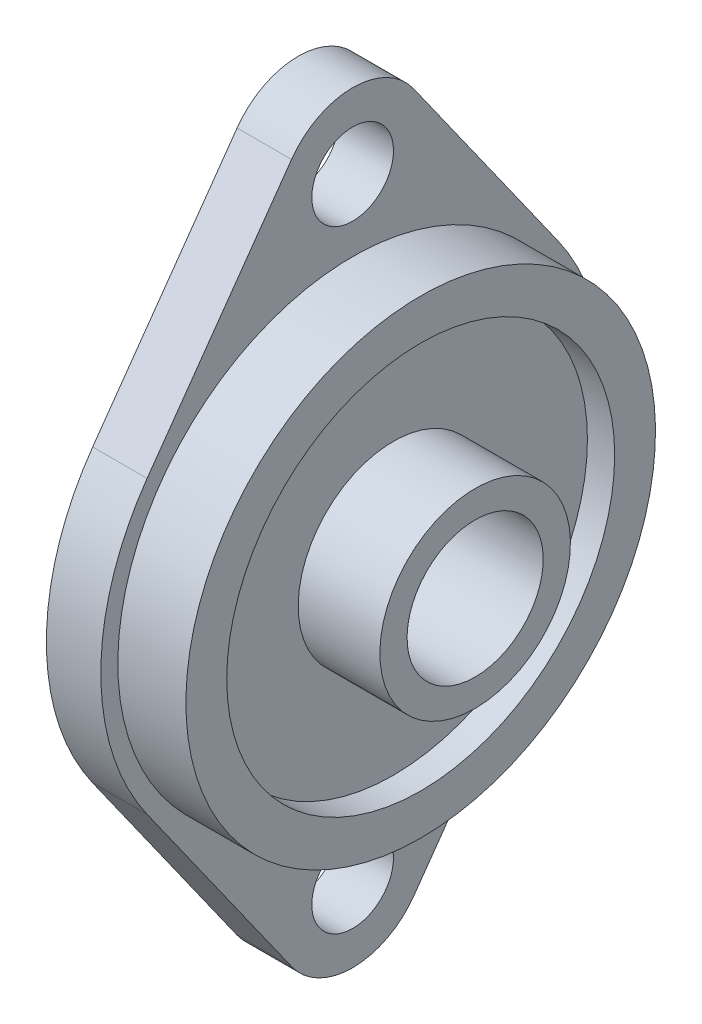
ISO-10303-21;
HEADER;
FILE_DESCRIPTION(('STEP AP214'),'2;1');
FILE_NAME('part.step','',(''),(''),'','','');
FILE_SCHEMA(('AUTOMOTIVE_DESIGN { 1 0 10303 214 1 1 1 1 }'));
ENDSEC;
DATA;
#1=APPLICATION_CONTEXT('core data for automotive mechanical design processes');
#2=APPLICATION_PROTOCOL_DEFINITION('international standard','automotive_design',2000,#1);
#3=PRODUCT_CONTEXT('',#1,'mechanical');
#4=PRODUCT('Part','Part','',(#3));
#5=PRODUCT_RELATED_PRODUCT_CATEGORY('part','',(#4));
#6=PRODUCT_DEFINITION_FORMATION('','',#4);
#7=PRODUCT_DEFINITION_CONTEXT('part definition',#1,'design');
#8=PRODUCT_DEFINITION('design','',#6,#7);
#9=PRODUCT_DEFINITION_SHAPE('','',#8);
#10=(LENGTH_UNIT() NAMED_UNIT(*) SI_UNIT(.MILLI.,.METRE.));
#11=(NAMED_UNIT(*) PLANE_ANGLE_UNIT() SI_UNIT($,.RADIAN.));
#12=(NAMED_UNIT(*) SI_UNIT($,.STERADIAN.) SOLID_ANGLE_UNIT());
#13=UNCERTAINTY_MEASURE_WITH_UNIT(LENGTH_MEASURE(1.E-05),#10,'distance_accuracy_value','');
#14=(GEOMETRIC_REPRESENTATION_CONTEXT(3) GLOBAL_UNCERTAINTY_ASSIGNED_CONTEXT((#13)) GLOBAL_UNIT_ASSIGNED_CONTEXT((#10,
#11,#12)) REPRESENTATION_CONTEXT('',''));
#15=CARTESIAN_POINT('',(0.,0.,0.));
#16=DIRECTION('',(0.,0.,1.));
#17=DIRECTION('',(1.,0.,0.));
#18=AXIS2_PLACEMENT_3D('',#15,#16,#17);
#19=CARTESIAN_POINT('',(0.,6.00408611717285E-12,0.));
#20=DIRECTION('',(1.,0.,0.));
#21=DIRECTION('',(0.,1.,0.));
#22=AXIS2_PLACEMENT_3D('',#19,#20,#21);
#23=PLANE('',#22);
#24=CARTESIAN_POINT('',(0.,-22.5,0.));
#25=DIRECTION('',(-1.,0.,0.));
#26=DIRECTION('',(0.,1.,0.));
#27=AXIS2_PLACEMENT_3D('',#24,#25,#26);
#28=CIRCLE('',#27,3.);
#29=CARTESIAN_POINT('',(0.,-25.5,0.));
#30=VERTEX_POINT('',#29);
#31=EDGE_CURVE('P0_E351',#30,#30,#28,.T.);
#32=ORIENTED_EDGE('',*,*,#31,.F.);
#33=EDGE_LOOP('',(#32));
#34=FACE_BOUND('',#33,.T.);
#35=CARTESIAN_POINT('',(0.,22.5,0.));
#36=DIRECTION('',(-1.,0.,0.));
#37=DIRECTION('',(0.,1.,0.));
#38=AXIS2_PLACEMENT_3D('',#35,#36,#37);
#39=CIRCLE('',#38,3.);
#40=CARTESIAN_POINT('',(0.,19.5,0.));
#41=VERTEX_POINT('',#40);
#42=EDGE_CURVE('P0_E155',#41,#41,#39,.T.);
#43=ORIENTED_EDGE('',*,*,#42,.F.);
#44=EDGE_LOOP('',(#43));
#45=FACE_BOUND('',#44,.T.);
#46=CARTESIAN_POINT('',(0.,0.,0.));
#47=DIRECTION('',(-1.,0.,0.));
#48=DIRECTION('',(0.,1.,0.));
#49=AXIS2_PLACEMENT_3D('',#46,#47,#48);
#50=CIRCLE('',#49,14.25);
#51=CARTESIAN_POINT('',(0.,-14.25,0.));
#52=VERTEX_POINT('',#51);
#53=EDGE_CURVE('P0_E330',#52,#52,#50,.T.);
#54=ORIENTED_EDGE('',*,*,#53,.F.);
#55=EDGE_LOOP('',(#54));
#56=FACE_BOUND('',#55,.T.);
#57=CARTESIAN_POINT('',(0.,-22.5,0.));
#58=DIRECTION('',(1.,0.,0.));
#59=DIRECTION('',(0.,-0.577777777778309,0.816194118764377));
#60=AXIS2_PLACEMENT_3D('',#57,#58,#59);
#61=CIRCLE('',#60,5.49999999998803);
#62=CARTESIAN_POINT('',(0.,-25.6777777777738,4.48906765319431));
#63=VERTEX_POINT('',#62);
#64=CARTESIAN_POINT('',(0.,-25.6777777777738,-4.48906765319431));
#65=VERTEX_POINT('',#64);
#66=EDGE_CURVE('P0_E25',#63,#65,#61,.T.);
#67=ORIENTED_EDGE('',*,*,#66,.F.);
#68=DIRECTION('',(0.,0.816194118764377,0.57777777777831));
#69=VECTOR('',#68,1.);
#70=CARTESIAN_POINT('',(0.,-25.6777777777738,4.48906765319431));
#71=LINE('',#70,#69);
#72=CARTESIAN_POINT('',(0.,-10.6888888888987,15.099591197141));
#73=VERTEX_POINT('',#72);
#74=EDGE_CURVE('P0_E148',#63,#73,#71,.T.);
#75=ORIENTED_EDGE('',*,*,#74,.T.);
#76=CARTESIAN_POINT('',(0.,0.,0.));
#77=DIRECTION('',(1.,0.,0.));
#78=DIRECTION('',(0.,0.577777777777771,0.816194118764759));
#79=AXIS2_PLACEMENT_3D('',#76,#77,#78);
#80=CIRCLE('',#79,18.5);
#81=CARTESIAN_POINT('',(0.,10.6888888888888,15.0995911971481));
#82=VERTEX_POINT('',#81);
#83=EDGE_CURVE('P0_E160',#82,#73,#80,.T.);
#84=ORIENTED_EDGE('',*,*,#83,.F.);
#85=DIRECTION('',(0.,-0.816194118764753,0.577777777777778));
#86=VECTOR('',#85,1.);
#87=CARTESIAN_POINT('',(0.,25.6777777777778,4.48906765320621));
#88=LINE('',#87,#86);
#89=CARTESIAN_POINT('',(0.,25.6777777777778,4.48906765320621));
#90=VERTEX_POINT('',#89);
#91=EDGE_CURVE('P0_E166',#90,#82,#88,.T.);
#92=ORIENTED_EDGE('',*,*,#91,.F.);
#93=CARTESIAN_POINT('',(0.,22.5,0.));
#94=DIRECTION('',(1.,0.,0.));
#95=DIRECTION('',(0.,0.577777777777771,-0.816194118764758));
#96=AXIS2_PLACEMENT_3D('',#93,#94,#95);
#97=CIRCLE('',#96,5.5);
#98=CARTESIAN_POINT('',(0.,25.6777777777778,-4.4890676532062));
#99=VERTEX_POINT('',#98);
#100=EDGE_CURVE('P0_E176',#99,#90,#97,.T.);
#101=ORIENTED_EDGE('',*,*,#100,.F.);
#102=DIRECTION('',(0.,-0.816194118764753,-0.577777777777778));
#103=VECTOR('',#102,1.);
#104=CARTESIAN_POINT('',(0.,25.6777777777778,-4.4890676532062));
#105=LINE('',#104,#103);
#106=CARTESIAN_POINT('',(0.,10.6888888888888,-15.099591197148));
#107=VERTEX_POINT('',#106);
#108=EDGE_CURVE('P0_E186',#99,#107,#105,.T.);
#109=ORIENTED_EDGE('',*,*,#108,.T.);
#110=CARTESIAN_POINT('',(0.,0.,0.));
#111=DIRECTION('',(1.,0.,0.));
#112=DIRECTION('',(0.,-0.57777777777831,-0.816194118764377));
#113=AXIS2_PLACEMENT_3D('',#110,#111,#112);
#114=CIRCLE('',#113,18.5);
#115=CARTESIAN_POINT('',(0.,-10.6888888888987,-15.099591197141));
#116=VERTEX_POINT('',#115);
#117=EDGE_CURVE('P0_E195',#116,#107,#114,.T.);
#118=ORIENTED_EDGE('',*,*,#117,.F.);
#119=DIRECTION('',(0.,0.816194118764377,-0.57777777777831));
#120=VECTOR('',#119,1.);
#121=CARTESIAN_POINT('',(0.,-25.6777777777738,-4.48906765319431));
#122=LINE('',#121,#120);
#123=EDGE_CURVE('P0_E158',#65,#116,#122,.T.);
#124=ORIENTED_EDGE('',*,*,#123,.F.);
#125=EDGE_LOOP('',(#67,#75,#84,#92,#101,#109,#118,#124));
#126=FACE_BOUND('',#125,.T.);
#127=ADVANCED_FACE('P0_F16',(#34,#45,#56,#126),#23,.F.);
#128=CARTESIAN_POINT('',(4.,6.00408611717285E-12,0.));
#129=DIRECTION('',(1.,0.,0.));
#130=DIRECTION('',(0.,1.,0.));
#131=AXIS2_PLACEMENT_3D('',#128,#129,#130);
#132=PLANE('',#131);
#133=CARTESIAN_POINT('',(4.,-22.5,0.));
#134=DIRECTION('',(-1.,0.,0.));
#135=DIRECTION('',(0.,1.,0.));
#136=AXIS2_PLACEMENT_3D('',#133,#134,#135);
#137=CIRCLE('',#136,3.);
#138=CARTESIAN_POINT('',(4.,-25.5,0.));
#139=VERTEX_POINT('',#138);
#140=EDGE_CURVE('P0_E336',#139,#139,#137,.T.);
#141=ORIENTED_EDGE('',*,*,#140,.T.);
#142=EDGE_LOOP('',(#141));
#143=FACE_BOUND('',#142,.T.);
#144=CARTESIAN_POINT('',(4.,22.5,0.));
#145=DIRECTION('',(-1.,0.,0.));
#146=DIRECTION('',(0.,1.,0.));
#147=AXIS2_PLACEMENT_3D('',#144,#145,#146);
#148=CIRCLE('',#147,3.);
#149=CARTESIAN_POINT('',(4.,19.5,0.));
#150=VERTEX_POINT('',#149);
#151=EDGE_CURVE('P0_E311',#150,#150,#148,.T.);
#152=ORIENTED_EDGE('',*,*,#151,.T.);
#153=EDGE_LOOP('',(#152));
#154=FACE_BOUND('',#153,.T.);
#155=CARTESIAN_POINT('',(4.,0.,0.));
#156=DIRECTION('',(-1.,0.,0.));
#157=DIRECTION('',(0.,1.,0.));
#158=AXIS2_PLACEMENT_3D('',#155,#156,#157);
#159=CIRCLE('',#158,17.25);
#160=CARTESIAN_POINT('',(4.,-17.25,0.));
#161=VERTEX_POINT('',#160);
#162=EDGE_CURVE('P0_E303',#161,#161,#159,.T.);
#163=ORIENTED_EDGE('',*,*,#162,.T.);
#164=EDGE_LOOP('',(#163));
#165=FACE_BOUND('',#164,.T.);
#166=CARTESIAN_POINT('',(4.,-22.5,0.));
#167=DIRECTION('',(1.,0.,0.));
#168=DIRECTION('',(0.,-0.577777777778309,0.816194118764377));
#169=AXIS2_PLACEMENT_3D('',#166,#167,#168);
#170=CIRCLE('',#169,5.49999999998803);
#171=CARTESIAN_POINT('',(4.,-25.6777777777738,4.48906765319431));
#172=VERTEX_POINT('',#171);
#173=CARTESIAN_POINT('',(4.,-25.6777777777738,-4.48906765319431));
#174=VERTEX_POINT('',#173);
#175=EDGE_CURVE('P0_E11',#172,#174,#170,.T.);
#176=ORIENTED_EDGE('',*,*,#175,.T.);
#177=DIRECTION('',(0.,0.816194118764377,-0.57777777777831));
#178=VECTOR('',#177,1.);
#179=CARTESIAN_POINT('',(4.,-25.6777777777738,-4.48906765319431));
#180=LINE('',#179,#178);
#181=CARTESIAN_POINT('',(4.,-10.6888888888987,-15.099591197141));
#182=VERTEX_POINT('',#181);
#183=EDGE_CURVE('P0_E205',#174,#182,#180,.T.);
#184=ORIENTED_EDGE('',*,*,#183,.T.);
#185=CARTESIAN_POINT('',(4.,0.,0.));
#186=DIRECTION('',(1.,0.,0.));
#187=DIRECTION('',(0.,-0.57777777777831,-0.816194118764377));
#188=AXIS2_PLACEMENT_3D('',#185,#186,#187);
#189=CIRCLE('',#188,18.5);
#190=CARTESIAN_POINT('',(4.,10.6888888888888,-15.099591197148));
#191=VERTEX_POINT('',#190);
#192=EDGE_CURVE('P0_E198',#182,#191,#189,.T.);
#193=ORIENTED_EDGE('',*,*,#192,.T.);
#194=DIRECTION('',(0.,0.816194118764753,0.577777777777778));
#195=VECTOR('',#194,1.);
#196=CARTESIAN_POINT('',(4.,25.6777777777778,-4.4890676532062));
#197=LINE('',#196,#195);
#198=CARTESIAN_POINT('',(4.,25.6777777777778,-4.4890676532062));
#199=VERTEX_POINT('',#198);
#200=EDGE_CURVE('P0_E190',#191,#199,#197,.T.);
#201=ORIENTED_EDGE('',*,*,#200,.T.);
#202=CARTESIAN_POINT('',(4.,22.5,0.));
#203=DIRECTION('',(1.,0.,0.));
#204=DIRECTION('',(0.,0.577777777777771,-0.816194118764758));
#205=AXIS2_PLACEMENT_3D('',#202,#203,#204);
#206=CIRCLE('',#205,5.5);
#207=CARTESIAN_POINT('',(4.,25.6777777777778,4.48906765320621));
#208=VERTEX_POINT('',#207);
#209=EDGE_CURVE('P0_E179',#199,#208,#206,.T.);
#210=ORIENTED_EDGE('',*,*,#209,.T.);
#211=DIRECTION('',(0.,-0.816194118764753,0.577777777777778));
#212=VECTOR('',#211,1.);
#213=CARTESIAN_POINT('',(4.,25.6777777777778,4.48906765320621));
#214=LINE('',#213,#212);
#215=CARTESIAN_POINT('',(4.,10.6888888888888,15.0995911971481));
#216=VERTEX_POINT('',#215);
#217=EDGE_CURVE('P0_E169',#208,#216,#214,.T.);
#218=ORIENTED_EDGE('',*,*,#217,.T.);
#219=CARTESIAN_POINT('',(4.,0.,0.));
#220=DIRECTION('',(1.,0.,0.));
#221=DIRECTION('',(0.,0.577777777777771,0.816194118764759));
#222=AXIS2_PLACEMENT_3D('',#219,#220,#221);
#223=CIRCLE('',#222,18.5);
#224=CARTESIAN_POINT('',(4.,-10.6888888888987,15.099591197141));
#225=VERTEX_POINT('',#224);
#226=EDGE_CURVE('P0_E139',#216,#225,#223,.T.);
#227=ORIENTED_EDGE('',*,*,#226,.T.);
#228=DIRECTION('',(0.,-0.816194118764377,-0.57777777777831));
#229=VECTOR('',#228,1.);
#230=CARTESIAN_POINT('',(4.,-25.6777777777738,4.48906765319431));
#231=LINE('',#230,#229);
#232=EDGE_CURVE('P0_E137',#225,#172,#231,.T.);
#233=ORIENTED_EDGE('',*,*,#232,.T.);
#234=EDGE_LOOP('',(#176,#184,#193,#201,#210,#218,#227,#233));
#235=FACE_BOUND('',#234,.T.);
#236=ADVANCED_FACE('P0_F18',(#143,#154,#165,#235),#132,.T.);
#237=CARTESIAN_POINT('',(0.,-22.5,0.));
#238=DIRECTION('',(1.,0.,0.));
#239=DIRECTION('',(0.,-0.577777777778309,0.816194118764377));
#240=AXIS2_PLACEMENT_3D('',#237,#238,#239);
#241=CYLINDRICAL_SURFACE('',#240,5.49999999998803);
#242=ORIENTED_EDGE('',*,*,#66,.T.);
#243=DIRECTION('',(1.,0.,0.));
#244=VECTOR('',#243,1.);
#245=CARTESIAN_POINT('',(0.,-25.6777777777738,-4.48906765319431));
#246=LINE('',#245,#244);
#247=EDGE_CURVE('P0_E134',#65,#174,#246,.T.);
#248=ORIENTED_EDGE('',*,*,#247,.T.);
#249=ORIENTED_EDGE('',*,*,#175,.F.);
#250=DIRECTION('',(1.,0.,0.));
#251=VECTOR('',#250,1.);
#252=CARTESIAN_POINT('',(0.,-25.6777777777738,4.48906765319431));
#253=LINE('',#252,#251);
#254=EDGE_CURVE('P0_E132',#63,#172,#253,.T.);
#255=ORIENTED_EDGE('',*,*,#254,.F.);
#256=EDGE_LOOP('',(#242,#248,#249,#255));
#257=FACE_BOUND('',#256,.T.);
#258=ADVANCED_FACE('P0_F130',(#257),#241,.T.);
#259=CARTESIAN_POINT('',(0.,-25.6777777777738,-4.48906765319431));
#260=DIRECTION('',(0.,-0.57777777777831,-0.816194118764377));
#261=DIRECTION('',(0.,-0.816194118764377,0.57777777777831));
#262=AXIS2_PLACEMENT_3D('',#259,#260,#261);
#263=PLANE('',#262);
#264=ORIENTED_EDGE('',*,*,#123,.T.);
#265=DIRECTION('',(1.,0.,0.));
#266=VECTOR('',#265,1.);
#267=CARTESIAN_POINT('',(0.,-10.6888888888987,-15.099591197141));
#268=LINE('',#267,#266);
#269=EDGE_CURVE('P0_E201',#116,#182,#268,.T.);
#270=ORIENTED_EDGE('',*,*,#269,.T.);
#271=ORIENTED_EDGE('',*,*,#183,.F.);
#272=ORIENTED_EDGE('',*,*,#247,.F.);
#273=EDGE_LOOP('',(#264,#270,#271,#272));
#274=FACE_BOUND('',#273,.T.);
#275=ADVANCED_FACE('P0_F386',(#274),#263,.T.);
#276=CARTESIAN_POINT('',(0.,0.,0.));
#277=DIRECTION('',(1.,0.,0.));
#278=DIRECTION('',(0.,-0.57777777777831,-0.816194118764377));
#279=AXIS2_PLACEMENT_3D('',#276,#277,#278);
#280=CYLINDRICAL_SURFACE('',#279,18.5);
#281=ORIENTED_EDGE('',*,*,#117,.T.);
#282=DIRECTION('',(1.,0.,0.));
#283=VECTOR('',#282,1.);
#284=CARTESIAN_POINT('',(0.,10.6888888888888,-15.099591197148));
#285=LINE('',#284,#283);
#286=EDGE_CURVE('P0_E191',#107,#191,#285,.T.);
#287=ORIENTED_EDGE('',*,*,#286,.T.);
#288=ORIENTED_EDGE('',*,*,#192,.F.);
#289=ORIENTED_EDGE('',*,*,#269,.F.);
#290=EDGE_LOOP('',(#281,#287,#288,#289));
#291=FACE_BOUND('',#290,.T.);
#292=ADVANCED_FACE('P0_F416',(#291),#280,.T.);
#293=CARTESIAN_POINT('',(0.,10.6888888888888,-15.0995911971481));
#294=DIRECTION('',(0.,0.577777777777778,-0.816194118764754));
#295=DIRECTION('',(-1.,0.,0.));
#296=AXIS2_PLACEMENT_3D('',#293,#294,#295);
#297=PLANE('',#296);
#298=ORIENTED_EDGE('',*,*,#108,.F.);
#299=DIRECTION('',(1.,0.,0.));
#300=VECTOR('',#299,1.);
#301=CARTESIAN_POINT('',(0.,25.6777777777778,-4.4890676532062));
#302=LINE('',#301,#300);
#303=EDGE_CURVE('P0_E182',#99,#199,#302,.T.);
#304=ORIENTED_EDGE('',*,*,#303,.T.);
#305=ORIENTED_EDGE('',*,*,#200,.F.);
#306=ORIENTED_EDGE('',*,*,#286,.F.);
#307=EDGE_LOOP('',(#298,#304,#305,#306));
#308=FACE_BOUND('',#307,.T.);
#309=ADVANCED_FACE('P0_F427',(#308),#297,.T.);
#310=CARTESIAN_POINT('',(0.,22.5,0.));
#311=DIRECTION('',(1.,0.,0.));
#312=DIRECTION('',(0.,0.577777777777771,-0.816194118764758));
#313=AXIS2_PLACEMENT_3D('',#310,#311,#312);
#314=CYLINDRICAL_SURFACE('',#313,5.5);
#315=ORIENTED_EDGE('',*,*,#100,.T.);
#316=DIRECTION('',(1.,0.,0.));
#317=VECTOR('',#316,1.);
#318=CARTESIAN_POINT('',(0.,25.6777777777778,4.48906765320621));
#319=LINE('',#318,#317);
#320=EDGE_CURVE('P0_E172',#90,#208,#319,.T.);
#321=ORIENTED_EDGE('',*,*,#320,.T.);
#322=ORIENTED_EDGE('',*,*,#209,.F.);
#323=ORIENTED_EDGE('',*,*,#303,.F.);
#324=EDGE_LOOP('',(#315,#321,#322,#323));
#325=FACE_BOUND('',#324,.T.);
#326=ADVANCED_FACE('P0_F423',(#325),#314,.T.);
#327=CARTESIAN_POINT('',(0.,25.6777777777778,4.48906765320621));
#328=DIRECTION('',(0.,0.577777777777778,0.816194118764754));
#329=DIRECTION('',(1.,0.,0.));
#330=AXIS2_PLACEMENT_3D('',#327,#328,#329);
#331=PLANE('',#330);
#332=ORIENTED_EDGE('',*,*,#91,.T.);
#333=DIRECTION('',(1.,0.,0.));
#334=VECTOR('',#333,1.);
#335=CARTESIAN_POINT('',(0.,10.6888888888888,15.0995911971481));
#336=LINE('',#335,#334);
#337=EDGE_CURVE('P0_E165',#82,#216,#336,.T.);
#338=ORIENTED_EDGE('',*,*,#337,.T.);
#339=ORIENTED_EDGE('',*,*,#217,.F.);
#340=ORIENTED_EDGE('',*,*,#320,.F.);
#341=EDGE_LOOP('',(#332,#338,#339,#340));
#342=FACE_BOUND('',#341,.T.);
#343=ADVANCED_FACE('P0_F420',(#342),#331,.T.);
#344=CARTESIAN_POINT('',(0.,0.,0.));
#345=DIRECTION('',(1.,0.,0.));
#346=DIRECTION('',(0.,0.577777777777771,0.816194118764759));
#347=AXIS2_PLACEMENT_3D('',#344,#345,#346);
#348=CYLINDRICAL_SURFACE('',#347,18.5);
#349=ORIENTED_EDGE('',*,*,#83,.T.);
#350=DIRECTION('',(1.,0.,0.));
#351=VECTOR('',#350,1.);
#352=CARTESIAN_POINT('',(0.,-10.6888888888987,15.099591197141));
#353=LINE('',#352,#351);
#354=EDGE_CURVE('P0_E144',#73,#225,#353,.T.);
#355=ORIENTED_EDGE('',*,*,#354,.T.);
#356=ORIENTED_EDGE('',*,*,#226,.F.);
#357=ORIENTED_EDGE('',*,*,#337,.F.);
#358=EDGE_LOOP('',(#349,#355,#356,#357));
#359=FACE_BOUND('',#358,.T.);
#360=ADVANCED_FACE('P0_F403',(#359),#348,.T.);
#361=CARTESIAN_POINT('',(0.,-10.6888888888987,15.099591197141));
#362=DIRECTION('',(0.,-0.57777777777831,0.816194118764377));
#363=DIRECTION('',(-1.,0.,0.));
#364=AXIS2_PLACEMENT_3D('',#361,#362,#363);
#365=PLANE('',#364);
#366=ORIENTED_EDGE('',*,*,#74,.F.);
#367=ORIENTED_EDGE('',*,*,#254,.T.);
#368=ORIENTED_EDGE('',*,*,#232,.F.);
#369=ORIENTED_EDGE('',*,*,#354,.F.);
#370=EDGE_LOOP('',(#366,#367,#368,#369));
#371=FACE_BOUND('',#370,.T.);
#372=ADVANCED_FACE('P0_F146',(#371),#365,.T.);
#373=CARTESIAN_POINT('',(0.,22.5,0.));
#374=DIRECTION('',(1.,0.,0.));
#375=DIRECTION('',(0.,1.,0.));
#376=AXIS2_PLACEMENT_3D('',#373,#374,#375);
#377=CYLINDRICAL_SURFACE('',#376,3.);
#378=ORIENTED_EDGE('',*,*,#151,.F.);
#379=DIRECTION('',(-1.,0.,0.));
#380=VECTOR('',#379,1.);
#381=CARTESIAN_POINT('',(0.,19.5,0.));
#382=LINE('',#381,#380);
#383=EDGE_CURVE('P0_E307',#150,#41,#382,.T.);
#384=ORIENTED_EDGE('',*,*,#383,.T.);
#385=ORIENTED_EDGE('',*,*,#42,.T.);
#386=ORIENTED_EDGE('',*,*,#383,.F.);
#387=EDGE_LOOP('',(#378,#384,#385,#386));
#388=FACE_BOUND('',#387,.T.);
#389=ADVANCED_FACE('P0_F393',(#388),#377,.F.);
#390=CARTESIAN_POINT('',(0.,-22.5,0.));
#391=DIRECTION('',(1.,0.,0.));
#392=DIRECTION('',(0.,1.,0.));
#393=AXIS2_PLACEMENT_3D('',#390,#391,#392);
#394=CYLINDRICAL_SURFACE('',#393,3.);
#395=ORIENTED_EDGE('',*,*,#140,.F.);
#396=DIRECTION('',(-1.,0.,0.));
#397=VECTOR('',#396,1.);
#398=CARTESIAN_POINT('',(0.,-25.5,0.));
#399=LINE('',#398,#397);
#400=EDGE_CURVE('P0_E344',#139,#30,#399,.T.);
#401=ORIENTED_EDGE('',*,*,#400,.T.);
#402=ORIENTED_EDGE('',*,*,#31,.T.);
#403=ORIENTED_EDGE('',*,*,#400,.F.);
#404=EDGE_LOOP('',(#395,#401,#402,#403));
#405=FACE_BOUND('',#404,.T.);
#406=ADVANCED_FACE('P0_F395',(#405),#394,.F.);
#407=CARTESIAN_POINT('',(9.,0.,0.));
#408=DIRECTION('',(1.,0.,0.));
#409=DIRECTION('',(0.,1.,0.));
#410=AXIS2_PLACEMENT_3D('',#407,#408,#409);
#411=PLANE('',#410);
#412=CARTESIAN_POINT('',(9.,0.,0.));
#413=DIRECTION('',(-1.,0.,0.));
#414=DIRECTION('',(0.,1.,0.));
#415=AXIS2_PLACEMENT_3D('',#412,#413,#414);
#416=CIRCLE('',#415,14.25);
#417=CARTESIAN_POINT('',(9.,-14.25,0.));
#418=VERTEX_POINT('',#417);
#419=EDGE_CURVE('P0_E317',#418,#418,#416,.T.);
#420=ORIENTED_EDGE('',*,*,#419,.T.);
#421=EDGE_LOOP('',(#420));
#422=FACE_BOUND('',#421,.T.);
#423=CARTESIAN_POINT('',(9.,0.,0.));
#424=DIRECTION('',(1.,0.,0.));
#425=DIRECTION('',(0.,1.,0.));
#426=AXIS2_PLACEMENT_3D('',#423,#424,#425);
#427=CIRCLE('',#426,17.25);
#428=CARTESIAN_POINT('',(9.,-17.25,0.));
#429=VERTEX_POINT('',#428);
#430=EDGE_CURVE('P0_E294',#429,#429,#427,.T.);
#431=ORIENTED_EDGE('',*,*,#430,.T.);
#432=EDGE_LOOP('',(#431));
#433=FACE_BOUND('',#432,.T.);
#434=ADVANCED_FACE('P0_F374',(#422,#433),#411,.T.);
#435=CARTESIAN_POINT('',(0.,0.,0.));
#436=DIRECTION('',(1.,0.,0.));
#437=DIRECTION('',(0.,1.,0.));
#438=AXIS2_PLACEMENT_3D('',#435,#436,#437);
#439=CYLINDRICAL_SURFACE('',#438,14.25);
#440=ORIENTED_EDGE('',*,*,#419,.F.);
#441=DIRECTION('',(-1.,0.,0.));
#442=VECTOR('',#441,1.);
#443=CARTESIAN_POINT('',(0.,-14.25,0.));
#444=LINE('',#443,#442);
#445=EDGE_CURVE('P0_E324',#418,#52,#444,.T.);
#446=ORIENTED_EDGE('',*,*,#445,.T.);
#447=ORIENTED_EDGE('',*,*,#53,.T.);
#448=ORIENTED_EDGE('',*,*,#445,.F.);
#449=EDGE_LOOP('',(#440,#446,#447,#448));
#450=FACE_BOUND('',#449,.T.);
#451=ADVANCED_FACE('P0_F407',(#450),#439,.F.);
#452=CARTESIAN_POINT('',(0.,0.,0.));
#453=DIRECTION('',(1.,0.,0.));
#454=DIRECTION('',(0.,1.,0.));
#455=AXIS2_PLACEMENT_3D('',#452,#453,#454);
#456=CYLINDRICAL_SURFACE('',#455,17.25);
#457=ORIENTED_EDGE('',*,*,#430,.F.);
#458=DIRECTION('',(-1.,0.,0.));
#459=VECTOR('',#458,1.);
#460=CARTESIAN_POINT('',(0.,-17.25,0.));
#461=LINE('',#460,#459);
#462=EDGE_CURVE('P0_E298',#429,#161,#461,.T.);
#463=ORIENTED_EDGE('',*,*,#462,.T.);
#464=ORIENTED_EDGE('',*,*,#162,.F.);
#465=ORIENTED_EDGE('',*,*,#462,.F.);
#466=EDGE_LOOP('',(#457,#463,#464,#465));
#467=FACE_BOUND('',#466,.T.);
#468=ADVANCED_FACE('P0_F376',(#467),#456,.T.);
#469=CLOSED_SHELL('',(#127,#236,#258,#275,#292,#309,#326,#343,#360,#372,#389,#406,#434,#451,#468));
#470=MANIFOLD_SOLID_BREP('P0_B1',#469);
#471=CARTESIAN_POINT('',(0.,0.,0.));
#472=DIRECTION('',(1.,0.,0.));
#473=DIRECTION('',(0.,1.,0.));
#474=AXIS2_PLACEMENT_3D('',#471,#472,#473);
#475=PLANE('',#474);
#476=CARTESIAN_POINT('',(0.,0.,0.));
#477=DIRECTION('',(-1.,0.,0.));
#478=DIRECTION('',(0.,1.,0.));
#479=AXIS2_PLACEMENT_3D('',#476,#477,#478);
#480=CIRCLE('',#479,7.);
#481=CARTESIAN_POINT('',(0.,-7.,0.));
#482=VERTEX_POINT('',#481);
#483=EDGE_CURVE('P1_E57',#482,#482,#480,.T.);
#484=ORIENTED_EDGE('',*,*,#483,.F.);
#485=EDGE_LOOP('',(#484));
#486=FACE_BOUND('',#485,.T.);
#487=CARTESIAN_POINT('',(0.,0.,0.));
#488=DIRECTION('',(1.,0.,0.));
#489=DIRECTION('',(0.,1.,0.));
#490=AXIS2_PLACEMENT_3D('',#487,#488,#489);
#491=CIRCLE('',#490,14.25);
#492=CARTESIAN_POINT('',(0.,-14.25,0.));
#493=VERTEX_POINT('',#492);
#494=EDGE_CURVE('P1_E11',#493,#493,#491,.T.);
#495=ORIENTED_EDGE('',*,*,#494,.F.);
#496=EDGE_LOOP('',(#495));
#497=FACE_BOUND('',#496,.T.);
#498=ADVANCED_FACE('P1_F16',(#486,#497),#475,.F.);
#499=CARTESIAN_POINT('',(7.,0.,0.));
#500=DIRECTION('',(1.,0.,0.));
#501=DIRECTION('',(0.,1.,0.));
#502=AXIS2_PLACEMENT_3D('',#499,#500,#501);
#503=PLANE('',#502);
#504=CARTESIAN_POINT('',(7.,0.,0.));
#505=DIRECTION('',(-1.,0.,0.));
#506=DIRECTION('',(0.,1.,0.));
#507=AXIS2_PLACEMENT_3D('',#504,#505,#506);
#508=CIRCLE('',#507,7.);
#509=CARTESIAN_POINT('',(7.,-7.,0.));
#510=VERTEX_POINT('',#509);
#511=EDGE_CURVE('P1_E55',#510,#510,#508,.T.);
#512=ORIENTED_EDGE('',*,*,#511,.T.);
#513=EDGE_LOOP('',(#512));
#514=FACE_BOUND('',#513,.T.);
#515=CARTESIAN_POINT('',(7.,0.,0.));
#516=DIRECTION('',(1.,0.,0.));
#517=DIRECTION('',(0.,1.,0.));
#518=AXIS2_PLACEMENT_3D('',#515,#516,#517);
#519=CIRCLE('',#518,14.25);
#520=CARTESIAN_POINT('',(7.,-14.25,0.));
#521=VERTEX_POINT('',#520);
#522=EDGE_CURVE('P1_E70',#521,#521,#519,.T.);
#523=ORIENTED_EDGE('',*,*,#522,.T.);
#524=EDGE_LOOP('',(#523));
#525=FACE_BOUND('',#524,.T.);
#526=ADVANCED_FACE('P1_F18',(#514,#525),#503,.T.);
#527=CARTESIAN_POINT('',(0.,0.,0.));
#528=DIRECTION('',(1.,0.,0.));
#529=DIRECTION('',(0.,1.,0.));
#530=AXIS2_PLACEMENT_3D('',#527,#528,#529);
#531=CYLINDRICAL_SURFACE('',#530,14.25);
#532=ORIENTED_EDGE('',*,*,#522,.F.);
#533=DIRECTION('',(-1.,0.,0.));
#534=VECTOR('',#533,1.);
#535=CARTESIAN_POINT('',(0.,-14.25,0.));
#536=LINE('',#535,#534);
#537=EDGE_CURVE('P1_E25',#521,#493,#536,.T.);
#538=ORIENTED_EDGE('',*,*,#537,.T.);
#539=ORIENTED_EDGE('',*,*,#494,.T.);
#540=ORIENTED_EDGE('',*,*,#537,.F.);
#541=EDGE_LOOP('',(#532,#538,#539,#540));
#542=FACE_BOUND('',#541,.T.);
#543=ADVANCED_FACE('P1_F75',(#542),#531,.T.);
#544=CARTESIAN_POINT('',(0.,0.,0.));
#545=DIRECTION('',(1.,0.,0.));
#546=DIRECTION('',(0.,1.,0.));
#547=AXIS2_PLACEMENT_3D('',#544,#545,#546);
#548=CYLINDRICAL_SURFACE('',#547,7.);
#549=ORIENTED_EDGE('',*,*,#511,.F.);
#550=DIRECTION('',(-1.,0.,0.));
#551=VECTOR('',#550,1.);
#552=CARTESIAN_POINT('',(0.,-7.,0.));
#553=LINE('',#552,#551);
#554=EDGE_CURVE('P1_E52',#510,#482,#553,.T.);
#555=ORIENTED_EDGE('',*,*,#554,.T.);
#556=ORIENTED_EDGE('',*,*,#483,.T.);
#557=ORIENTED_EDGE('',*,*,#554,.F.);
#558=EDGE_LOOP('',(#549,#555,#556,#557));
#559=FACE_BOUND('',#558,.T.);
#560=ADVANCED_FACE('P1_F54',(#559),#548,.F.);
#561=CLOSED_SHELL('',(#498,#526,#543,#560));
#562=MANIFOLD_SOLID_BREP('P1_B1',#561);
#563=CARTESIAN_POINT('',(0.,0.,0.));
#564=DIRECTION('',(1.,0.,0.));
#565=DIRECTION('',(0.,1.,0.));
#566=AXIS2_PLACEMENT_3D('',#563,#564,#565);
#567=PLANE('',#566);
#568=CARTESIAN_POINT('',(0.,0.,0.));
#569=DIRECTION('',(-1.,0.,0.));
#570=DIRECTION('',(0.,1.,0.));
#571=AXIS2_PLACEMENT_3D('',#568,#569,#570);
#572=CIRCLE('',#571,5.);
#573=CARTESIAN_POINT('',(0.,-5.,0.));
#574=VERTEX_POINT('',#573);
#575=EDGE_CURVE('P2_E55',#574,#574,#572,.T.);
#576=ORIENTED_EDGE('',*,*,#575,.F.);
#577=EDGE_LOOP('',(#576));
#578=FACE_BOUND('',#577,.T.);
#579=CARTESIAN_POINT('',(0.,0.,0.));
#580=DIRECTION('',(1.,0.,0.));
#581=DIRECTION('',(0.,1.,0.));
#582=AXIS2_PLACEMENT_3D('',#579,#580,#581);
#583=CIRCLE('',#582,7.);
#584=CARTESIAN_POINT('',(0.,-7.,0.));
#585=VERTEX_POINT('',#584);
#586=EDGE_CURVE('P2_E11',#585,#585,#583,.T.);
#587=ORIENTED_EDGE('',*,*,#586,.F.);
#588=EDGE_LOOP('',(#587));
#589=FACE_BOUND('',#588,.T.);
#590=ADVANCED_FACE('P2_F16',(#578,#589),#567,.F.);
#591=CARTESIAN_POINT('',(13.,0.,0.));
#592=DIRECTION('',(1.,0.,0.));
#593=DIRECTION('',(0.,1.,0.));
#594=AXIS2_PLACEMENT_3D('',#591,#592,#593);
#595=PLANE('',#594);
#596=CARTESIAN_POINT('',(13.,0.,0.));
#597=DIRECTION('',(-1.,0.,0.));
#598=DIRECTION('',(0.,1.,0.));
#599=AXIS2_PLACEMENT_3D('',#596,#597,#598);
#600=CIRCLE('',#599,5.);
#601=CARTESIAN_POINT('',(13.,-5.,0.));
#602=VERTEX_POINT('',#601);
#603=EDGE_CURVE('P2_E53',#602,#602,#600,.T.);
#604=ORIENTED_EDGE('',*,*,#603,.T.);
#605=EDGE_LOOP('',(#604));
#606=FACE_BOUND('',#605,.T.);
#607=CARTESIAN_POINT('',(13.,0.,0.));
#608=DIRECTION('',(1.,0.,0.));
#609=DIRECTION('',(0.,1.,0.));
#610=AXIS2_PLACEMENT_3D('',#607,#608,#609);
#611=CIRCLE('',#610,7.);
#612=CARTESIAN_POINT('',(13.,-7.,0.));
#613=VERTEX_POINT('',#612);
#614=EDGE_CURVE('P2_E69',#613,#613,#611,.T.);
#615=ORIENTED_EDGE('',*,*,#614,.T.);
#616=EDGE_LOOP('',(#615));
#617=FACE_BOUND('',#616,.T.);
#618=ADVANCED_FACE('P2_F59',(#606,#617),#595,.T.);
#619=CARTESIAN_POINT('',(0.,0.,0.));
#620=DIRECTION('',(1.,0.,0.));
#621=DIRECTION('',(0.,1.,0.));
#622=AXIS2_PLACEMENT_3D('',#619,#620,#621);
#623=CYLINDRICAL_SURFACE('',#622,7.);
#624=ORIENTED_EDGE('',*,*,#614,.F.);
#625=DIRECTION('',(-1.,0.,0.));
#626=VECTOR('',#625,1.);
#627=CARTESIAN_POINT('',(0.,-7.,0.));
#628=LINE('',#627,#626);
#629=EDGE_CURVE('P2_E24',#613,#585,#628,.T.);
#630=ORIENTED_EDGE('',*,*,#629,.T.);
#631=ORIENTED_EDGE('',*,*,#586,.T.);
#632=ORIENTED_EDGE('',*,*,#629,.F.);
#633=EDGE_LOOP('',(#624,#630,#631,#632));
#634=FACE_BOUND('',#633,.T.);
#635=ADVANCED_FACE('P2_F98',(#634),#623,.T.);
#636=CARTESIAN_POINT('',(0.,0.,0.));
#637=DIRECTION('',(1.,0.,0.));
#638=DIRECTION('',(0.,1.,0.));
#639=AXIS2_PLACEMENT_3D('',#636,#637,#638);
#640=CYLINDRICAL_SURFACE('',#639,5.);
#641=ORIENTED_EDGE('',*,*,#603,.F.);
#642=DIRECTION('',(-1.,0.,0.));
#643=VECTOR('',#642,1.);
#644=CARTESIAN_POINT('',(0.,-5.,0.));
#645=LINE('',#644,#643);
#646=EDGE_CURVE('P2_E50',#602,#574,#645,.T.);
#647=ORIENTED_EDGE('',*,*,#646,.T.);
#648=ORIENTED_EDGE('',*,*,#575,.T.);
#649=ORIENTED_EDGE('',*,*,#646,.F.);
#650=EDGE_LOOP('',(#641,#647,#648,#649));
#651=FACE_BOUND('',#650,.T.);
#652=ADVANCED_FACE('P2_F52',(#651),#640,.F.);
#653=CLOSED_SHELL('',(#590,#618,#635,#652));
#654=MANIFOLD_SOLID_BREP('P2_B1',#653);
#655=ADVANCED_BREP_SHAPE_REPRESENTATION('',(#18,#470,#562,#654),#14);
#656=SHAPE_DEFINITION_REPRESENTATION(#9,#655);
ENDSEC;
END-ISO-10303-21;
